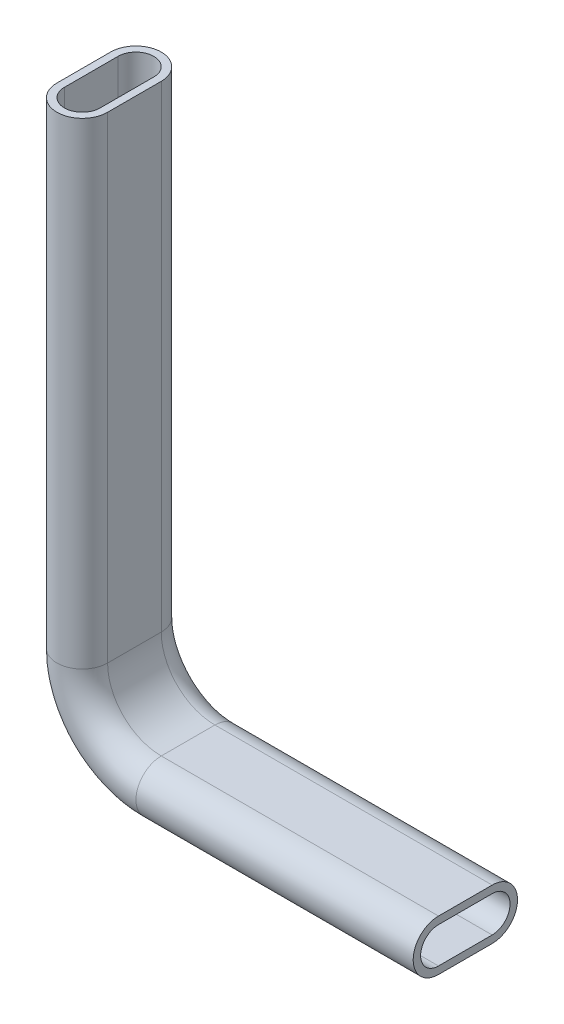
ISO-10303-21;
HEADER;
FILE_DESCRIPTION(('STEP AP214'),'2;1');
FILE_NAME('part.step','',(''),(''),'','','');
FILE_SCHEMA(('AUTOMOTIVE_DESIGN { 1 0 10303 214 1 1 1 1 }'));
ENDSEC;
DATA;
#1=APPLICATION_CONTEXT('core data for automotive mechanical design processes');
#2=APPLICATION_PROTOCOL_DEFINITION('international standard','automotive_design',2000,#1);
#3=PRODUCT_CONTEXT('',#1,'mechanical');
#4=PRODUCT('Part','Part','',(#3));
#5=PRODUCT_RELATED_PRODUCT_CATEGORY('part','',(#4));
#6=PRODUCT_DEFINITION_FORMATION('','',#4);
#7=PRODUCT_DEFINITION_CONTEXT('part definition',#1,'design');
#8=PRODUCT_DEFINITION('design','',#6,#7);
#9=PRODUCT_DEFINITION_SHAPE('','',#8);
#10=(LENGTH_UNIT() NAMED_UNIT(*) SI_UNIT(.MILLI.,.METRE.));
#11=(NAMED_UNIT(*) PLANE_ANGLE_UNIT() SI_UNIT($,.RADIAN.));
#12=(NAMED_UNIT(*) SI_UNIT($,.STERADIAN.) SOLID_ANGLE_UNIT());
#13=UNCERTAINTY_MEASURE_WITH_UNIT(LENGTH_MEASURE(1.E-05),#10,'distance_accuracy_value','');
#14=(GEOMETRIC_REPRESENTATION_CONTEXT(3) GLOBAL_UNCERTAINTY_ASSIGNED_CONTEXT((#13)) GLOBAL_UNIT_ASSIGNED_CONTEXT((#10,
#11,#12)) REPRESENTATION_CONTEXT('',''));
#15=CARTESIAN_POINT('',(0.,0.,0.));
#16=DIRECTION('',(0.,0.,1.));
#17=DIRECTION('',(1.,0.,0.));
#18=AXIS2_PLACEMENT_3D('',#15,#16,#17);
#19=CARTESIAN_POINT('',(-111.,26.5,9.));
#20=DIRECTION('',(-1.,0.,0.));
#21=DIRECTION('',(0.,0.,1.));
#22=AXIS2_PLACEMENT_3D('',#19,#20,#21);
#23=PLANE('',#22);
#24=DIRECTION('',(0.,0.,1.));
#25=VECTOR('',#24,1.);
#26=CARTESIAN_POINT('',(-111.,26.5,9.));
#27=LINE('',#26,#25);
#28=CARTESIAN_POINT('',(-111.,26.5,-9.));
#29=VERTEX_POINT('',#28);
#30=CARTESIAN_POINT('',(-111.,26.5,9.));
#31=VERTEX_POINT('',#30);
#32=EDGE_CURVE('E240',#29,#31,#27,.T.);
#33=ORIENTED_EDGE('',*,*,#32,.F.);
#34=DIRECTION('',(0.,1.,0.));
#35=VECTOR('',#34,1.);
#36=CARTESIAN_POINT('',(-111.,26.5,-9.));
#37=LINE('',#36,#35);
#38=CARTESIAN_POINT('',(-111.,186.5,-9.));
#39=VERTEX_POINT('',#38);
#40=EDGE_CURVE('E33',#29,#39,#37,.T.);
#41=ORIENTED_EDGE('',*,*,#40,.T.);
#42=DIRECTION('',(0.,0.,1.));
#43=VECTOR('',#42,1.);
#44=CARTESIAN_POINT('',(-111.,186.5,9.));
#45=LINE('',#44,#43);
#46=CARTESIAN_POINT('',(-111.,186.5,9.));
#47=VERTEX_POINT('',#46);
#48=EDGE_CURVE('E40',#39,#47,#45,.T.);
#49=ORIENTED_EDGE('',*,*,#48,.T.);
#50=DIRECTION('',(0.,1.,0.));
#51=VECTOR('',#50,1.);
#52=CARTESIAN_POINT('',(-111.,26.5,9.));
#53=LINE('',#52,#51);
#54=EDGE_CURVE('E11',#31,#47,#53,.T.);
#55=ORIENTED_EDGE('',*,*,#54,.F.);
#56=EDGE_LOOP('',(#33,#41,#49,#55));
#57=FACE_BOUND('',#56,.T.);
#58=ADVANCED_FACE('F26',(#57),#23,.F.);
#59=CARTESIAN_POINT('',(-119.5,26.5,-9.));
#60=DIRECTION('',(0.,1.,0.));
#61=DIRECTION('',(0.,0.,1.));
#62=AXIS2_PLACEMENT_3D('',#59,#60,#61);
#63=CYLINDRICAL_SURFACE('',#62,8.5);
#64=CARTESIAN_POINT('',(-119.5,26.5,-9.));
#65=DIRECTION('',(0.,-1.,0.));
#66=DIRECTION('',(0.,0.,1.));
#67=AXIS2_PLACEMENT_3D('',#64,#65,#66);
#68=CIRCLE('',#67,8.5);
#69=CARTESIAN_POINT('',(-128.,26.5,-9.));
#70=VERTEX_POINT('',#69);
#71=EDGE_CURVE('E237',#70,#29,#68,.T.);
#72=ORIENTED_EDGE('',*,*,#71,.F.);
#73=DIRECTION('',(0.,1.,0.));
#74=VECTOR('',#73,1.);
#75=CARTESIAN_POINT('',(-128.,26.5,-9.));
#76=LINE('',#75,#74);
#77=CARTESIAN_POINT('',(-128.,186.5,-9.));
#78=VERTEX_POINT('',#77);
#79=EDGE_CURVE('E298',#70,#78,#76,.T.);
#80=ORIENTED_EDGE('',*,*,#79,.T.);
#81=CARTESIAN_POINT('',(-119.5,186.5,-9.));
#82=DIRECTION('',(0.,-1.,0.));
#83=DIRECTION('',(0.,0.,1.));
#84=AXIS2_PLACEMENT_3D('',#81,#82,#83);
#85=CIRCLE('',#84,8.5);
#86=EDGE_CURVE('E48',#78,#39,#85,.T.);
#87=ORIENTED_EDGE('',*,*,#86,.T.);
#88=ORIENTED_EDGE('',*,*,#40,.F.);
#89=EDGE_LOOP('',(#72,#80,#87,#88));
#90=FACE_BOUND('',#89,.T.);
#91=ADVANCED_FACE('F301',(#90),#63,.T.);
#92=CARTESIAN_POINT('',(-128.,26.5,9.));
#93=DIRECTION('',(1.,0.,0.));
#94=DIRECTION('',(0.,0.,-1.));
#95=AXIS2_PLACEMENT_3D('',#92,#93,#94);
#96=PLANE('',#95);
#97=DIRECTION('',(0.,0.,-1.));
#98=VECTOR('',#97,1.);
#99=CARTESIAN_POINT('',(-128.,26.5,9.));
#100=LINE('',#99,#98);
#101=CARTESIAN_POINT('',(-128.,26.5,9.));
#102=VERTEX_POINT('',#101);
#103=EDGE_CURVE('E233',#102,#70,#100,.T.);
#104=ORIENTED_EDGE('',*,*,#103,.F.);
#105=DIRECTION('',(0.,1.,0.));
#106=VECTOR('',#105,1.);
#107=CARTESIAN_POINT('',(-128.,26.5,9.));
#108=LINE('',#107,#106);
#109=CARTESIAN_POINT('',(-128.,186.5,9.));
#110=VERTEX_POINT('',#109);
#111=EDGE_CURVE('E285',#102,#110,#108,.T.);
#112=ORIENTED_EDGE('',*,*,#111,.T.);
#113=DIRECTION('',(0.,0.,-1.));
#114=VECTOR('',#113,1.);
#115=CARTESIAN_POINT('',(-128.,186.5,9.));
#116=LINE('',#115,#114);
#117=EDGE_CURVE('E280',#110,#78,#116,.T.);
#118=ORIENTED_EDGE('',*,*,#117,.T.);
#119=ORIENTED_EDGE('',*,*,#79,.F.);
#120=EDGE_LOOP('',(#104,#112,#118,#119));
#121=FACE_BOUND('',#120,.T.);
#122=ADVANCED_FACE('F347',(#121),#96,.F.);
#123=CARTESIAN_POINT('',(-119.5,26.5,9.));
#124=DIRECTION('',(0.,1.,0.));
#125=DIRECTION('',(0.,0.,1.));
#126=AXIS2_PLACEMENT_3D('',#123,#124,#125);
#127=CYLINDRICAL_SURFACE('',#126,8.5);
#128=CARTESIAN_POINT('',(-119.5,26.5,9.));
#129=DIRECTION('',(0.,-1.,0.));
#130=DIRECTION('',(0.,0.,-1.));
#131=AXIS2_PLACEMENT_3D('',#128,#129,#130);
#132=CIRCLE('',#131,8.5);
#133=EDGE_CURVE('E230',#31,#102,#132,.T.);
#134=ORIENTED_EDGE('',*,*,#133,.F.);
#135=ORIENTED_EDGE('',*,*,#54,.T.);
#136=CARTESIAN_POINT('',(-119.5,186.5,9.));
#137=DIRECTION('',(0.,-1.,0.));
#138=DIRECTION('',(0.,0.,-1.));
#139=AXIS2_PLACEMENT_3D('',#136,#137,#138);
#140=CIRCLE('',#139,8.5);
#141=EDGE_CURVE('E278',#47,#110,#140,.T.);
#142=ORIENTED_EDGE('',*,*,#141,.T.);
#143=ORIENTED_EDGE('',*,*,#111,.F.);
#144=EDGE_LOOP('',(#134,#135,#142,#143));
#145=FACE_BOUND('',#144,.T.);
#146=ADVANCED_FACE('F328',(#145),#127,.T.);
#147=CARTESIAN_POINT('',(-125.5,26.5,9.));
#148=DIRECTION('',(1.,0.,0.));
#149=DIRECTION('',(0.,0.,-1.));
#150=AXIS2_PLACEMENT_3D('',#147,#148,#149);
#151=PLANE('',#150);
#152=DIRECTION('',(0.,0.,-1.));
#153=VECTOR('',#152,1.);
#154=CARTESIAN_POINT('',(-125.5,26.5,9.));
#155=LINE('',#154,#153);
#156=CARTESIAN_POINT('',(-125.5,26.5,9.));
#157=VERTEX_POINT('',#156);
#158=CARTESIAN_POINT('',(-125.5,26.5,-9.));
#159=VERTEX_POINT('',#158);
#160=EDGE_CURVE('E226',#157,#159,#155,.T.);
#161=ORIENTED_EDGE('',*,*,#160,.T.);
#162=DIRECTION('',(0.,1.,0.));
#163=VECTOR('',#162,1.);
#164=CARTESIAN_POINT('',(-125.5,26.5,-9.));
#165=LINE('',#164,#163);
#166=CARTESIAN_POINT('',(-125.5,186.5,-9.));
#167=VERTEX_POINT('',#166);
#168=EDGE_CURVE('E291',#159,#167,#165,.T.);
#169=ORIENTED_EDGE('',*,*,#168,.T.);
#170=DIRECTION('',(0.,0.,-1.));
#171=VECTOR('',#170,1.);
#172=CARTESIAN_POINT('',(-125.5,186.5,9.));
#173=LINE('',#172,#171);
#174=CARTESIAN_POINT('',(-125.5,186.5,9.));
#175=VERTEX_POINT('',#174);
#176=EDGE_CURVE('E274',#175,#167,#173,.T.);
#177=ORIENTED_EDGE('',*,*,#176,.F.);
#178=DIRECTION('',(0.,1.,0.));
#179=VECTOR('',#178,1.);
#180=CARTESIAN_POINT('',(-125.5,26.5,9.));
#181=LINE('',#180,#179);
#182=EDGE_CURVE('E281',#157,#175,#181,.T.);
#183=ORIENTED_EDGE('',*,*,#182,.F.);
#184=EDGE_LOOP('',(#161,#169,#177,#183));
#185=FACE_BOUND('',#184,.T.);
#186=ADVANCED_FACE('F355',(#185),#151,.T.);
#187=CARTESIAN_POINT('',(-119.5,26.5,-9.));
#188=DIRECTION('',(0.,1.,0.));
#189=DIRECTION('',(0.,0.,1.));
#190=AXIS2_PLACEMENT_3D('',#187,#188,#189);
#191=CYLINDRICAL_SURFACE('',#190,6.);
#192=CARTESIAN_POINT('',(-119.5,26.5,-9.));
#193=DIRECTION('',(0.,-1.,0.));
#194=DIRECTION('',(0.,0.,1.));
#195=AXIS2_PLACEMENT_3D('',#192,#193,#194);
#196=CIRCLE('',#195,6.);
#197=CARTESIAN_POINT('',(-113.5,26.5,-9.));
#198=VERTEX_POINT('',#197);
#199=EDGE_CURVE('E223',#159,#198,#196,.T.);
#200=ORIENTED_EDGE('',*,*,#199,.T.);
#201=DIRECTION('',(0.,1.,0.));
#202=VECTOR('',#201,1.);
#203=CARTESIAN_POINT('',(-113.5,26.5,-9.));
#204=LINE('',#203,#202);
#205=CARTESIAN_POINT('',(-113.5,186.5,-9.));
#206=VERTEX_POINT('',#205);
#207=EDGE_CURVE('E288',#198,#206,#204,.T.);
#208=ORIENTED_EDGE('',*,*,#207,.T.);
#209=CARTESIAN_POINT('',(-119.5,186.5,-9.));
#210=DIRECTION('',(0.,-1.,0.));
#211=DIRECTION('',(0.,0.,1.));
#212=AXIS2_PLACEMENT_3D('',#209,#210,#211);
#213=CIRCLE('',#212,6.);
#214=EDGE_CURVE('E271',#167,#206,#213,.T.);
#215=ORIENTED_EDGE('',*,*,#214,.F.);
#216=ORIENTED_EDGE('',*,*,#168,.F.);
#217=EDGE_LOOP('',(#200,#208,#215,#216));
#218=FACE_BOUND('',#217,.T.);
#219=ADVANCED_FACE('F358',(#218),#191,.F.);
#220=CARTESIAN_POINT('',(-113.5,26.5,9.));
#221=DIRECTION('',(-1.,0.,0.));
#222=DIRECTION('',(0.,0.,1.));
#223=AXIS2_PLACEMENT_3D('',#220,#221,#222);
#224=PLANE('',#223);
#225=DIRECTION('',(0.,0.,1.));
#226=VECTOR('',#225,1.);
#227=CARTESIAN_POINT('',(-113.5,26.5,9.));
#228=LINE('',#227,#226);
#229=CARTESIAN_POINT('',(-113.5,26.5,9.));
#230=VERTEX_POINT('',#229);
#231=EDGE_CURVE('E220',#198,#230,#228,.T.);
#232=ORIENTED_EDGE('',*,*,#231,.T.);
#233=DIRECTION('',(0.,1.,0.));
#234=VECTOR('',#233,1.);
#235=CARTESIAN_POINT('',(-113.5,26.5,9.));
#236=LINE('',#235,#234);
#237=CARTESIAN_POINT('',(-113.5,186.5,9.));
#238=VERTEX_POINT('',#237);
#239=EDGE_CURVE('E277',#230,#238,#236,.T.);
#240=ORIENTED_EDGE('',*,*,#239,.T.);
#241=DIRECTION('',(0.,0.,1.));
#242=VECTOR('',#241,1.);
#243=CARTESIAN_POINT('',(-113.5,186.5,9.));
#244=LINE('',#243,#242);
#245=EDGE_CURVE('E268',#206,#238,#244,.T.);
#246=ORIENTED_EDGE('',*,*,#245,.F.);
#247=ORIENTED_EDGE('',*,*,#207,.F.);
#248=EDGE_LOOP('',(#232,#240,#246,#247));
#249=FACE_BOUND('',#248,.T.);
#250=ADVANCED_FACE('F362',(#249),#224,.T.);
#251=CARTESIAN_POINT('',(-119.5,26.5,9.));
#252=DIRECTION('',(0.,1.,0.));
#253=DIRECTION('',(0.,0.,1.));
#254=AXIS2_PLACEMENT_3D('',#251,#252,#253);
#255=CYLINDRICAL_SURFACE('',#254,6.);
#256=CARTESIAN_POINT('',(-119.5,26.5,9.));
#257=DIRECTION('',(0.,-1.,0.));
#258=DIRECTION('',(0.,0.,-1.));
#259=AXIS2_PLACEMENT_3D('',#256,#257,#258);
#260=CIRCLE('',#259,6.);
#261=EDGE_CURVE('E205',#230,#157,#260,.T.);
#262=ORIENTED_EDGE('',*,*,#261,.T.);
#263=ORIENTED_EDGE('',*,*,#182,.T.);
#264=CARTESIAN_POINT('',(-119.5,186.5,9.));
#265=DIRECTION('',(0.,-1.,0.));
#266=DIRECTION('',(0.,0.,-1.));
#267=AXIS2_PLACEMENT_3D('',#264,#265,#266);
#268=CIRCLE('',#267,6.);
#269=EDGE_CURVE('E265',#238,#175,#268,.T.);
#270=ORIENTED_EDGE('',*,*,#269,.F.);
#271=ORIENTED_EDGE('',*,*,#239,.F.);
#272=EDGE_LOOP('',(#262,#263,#270,#271));
#273=FACE_BOUND('',#272,.T.);
#274=ADVANCED_FACE('F366',(#273),#255,.F.);
#275=CARTESIAN_POINT('',(-93.,26.5,0.));
#276=DIRECTION('',(0.,0.,-1.));
#277=DIRECTION('',(-1.,0.,0.));
#278=AXIS2_PLACEMENT_3D('',#275,#276,#277);
#279=CYLINDRICAL_SURFACE('',#278,18.);
#280=DIRECTION('',(0.,0.,1.));
#281=VECTOR('',#280,1.);
#282=CARTESIAN_POINT('',(-93.,8.5,9.));
#283=LINE('',#282,#281);
#284=CARTESIAN_POINT('',(-93.,8.5,-9.));
#285=VERTEX_POINT('',#284);
#286=CARTESIAN_POINT('',(-93.,8.5,9.));
#287=VERTEX_POINT('',#286);
#288=EDGE_CURVE('E160',#285,#287,#283,.T.);
#289=ORIENTED_EDGE('',*,*,#288,.F.);
#290=CARTESIAN_POINT('',(-93.,26.5,-9.));
#291=DIRECTION('',(0.,0.,-1.));
#292=DIRECTION('',(-1.,0.,0.));
#293=AXIS2_PLACEMENT_3D('',#290,#291,#292);
#294=CIRCLE('',#293,18.);
#295=EDGE_CURVE('E259',#285,#29,#294,.T.);
#296=ORIENTED_EDGE('',*,*,#295,.T.);
#297=ORIENTED_EDGE('',*,*,#32,.T.);
#298=CARTESIAN_POINT('',(-93.,26.5,9.));
#299=DIRECTION('',(0.,0.,-1.));
#300=DIRECTION('',(-1.,0.,0.));
#301=AXIS2_PLACEMENT_3D('',#298,#299,#300);
#302=CIRCLE('',#301,18.);
#303=EDGE_CURVE('E262',#287,#31,#302,.T.);
#304=ORIENTED_EDGE('',*,*,#303,.F.);
#305=EDGE_LOOP('',(#289,#296,#297,#304));
#306=FACE_BOUND('',#305,.T.);
#307=ADVANCED_FACE('F330',(#306),#279,.F.);
#308=CARTESIAN_POINT('',(-93.,26.5,-9.));
#309=DIRECTION('',(0.,0.,-1.));
#310=DIRECTION('',(-1.,0.,0.));
#311=AXIS2_PLACEMENT_3D('',#308,#309,#310);
#312=TOROIDAL_SURFACE('',#311,26.5,8.5);
#313=CARTESIAN_POINT('',(-93.,0.,-9.));
#314=DIRECTION('',(1.,0.,0.));
#315=DIRECTION('',(0.,0.,1.));
#316=AXIS2_PLACEMENT_3D('',#313,#314,#315);
#317=CIRCLE('',#316,8.5);
#318=CARTESIAN_POINT('',(-93.,-8.5,-9.));
#319=VERTEX_POINT('',#318);
#320=EDGE_CURVE('E198',#319,#285,#317,.T.);
#321=ORIENTED_EDGE('',*,*,#320,.F.);
#322=CARTESIAN_POINT('',(-93.,26.5,-9.));
#323=DIRECTION('',(0.,0.,-1.));
#324=DIRECTION('',(-1.,0.,0.));
#325=AXIS2_PLACEMENT_3D('',#322,#323,#324);
#326=CIRCLE('',#325,35.);
#327=EDGE_CURVE('E256',#319,#70,#326,.T.);
#328=ORIENTED_EDGE('',*,*,#327,.T.);
#329=ORIENTED_EDGE('',*,*,#71,.T.);
#330=ORIENTED_EDGE('',*,*,#295,.F.);
#331=EDGE_LOOP('',(#321,#328,#329,#330));
#332=FACE_BOUND('',#331,.T.);
#333=ADVANCED_FACE('F309',(#332),#312,.T.);
#334=CARTESIAN_POINT('',(-93.,26.5,0.));
#335=DIRECTION('',(0.,0.,-1.));
#336=DIRECTION('',(-1.,0.,0.));
#337=AXIS2_PLACEMENT_3D('',#334,#335,#336);
#338=CYLINDRICAL_SURFACE('',#337,35.);
#339=DIRECTION('',(0.,0.,-1.));
#340=VECTOR('',#339,1.);
#341=CARTESIAN_POINT('',(-93.,-8.5,9.));
#342=LINE('',#341,#340);
#343=CARTESIAN_POINT('',(-93.,-8.5,9.));
#344=VERTEX_POINT('',#343);
#345=EDGE_CURVE('E195',#344,#319,#342,.T.);
#346=ORIENTED_EDGE('',*,*,#345,.F.);
#347=CARTESIAN_POINT('',(-93.,26.5,9.));
#348=DIRECTION('',(0.,0.,-1.));
#349=DIRECTION('',(-1.,0.,0.));
#350=AXIS2_PLACEMENT_3D('',#347,#348,#349);
#351=CIRCLE('',#350,35.);
#352=EDGE_CURVE('E243',#344,#102,#351,.T.);
#353=ORIENTED_EDGE('',*,*,#352,.T.);
#354=ORIENTED_EDGE('',*,*,#103,.T.);
#355=ORIENTED_EDGE('',*,*,#327,.F.);
#356=EDGE_LOOP('',(#346,#353,#354,#355));
#357=FACE_BOUND('',#356,.T.);
#358=ADVANCED_FACE('F306',(#357),#338,.T.);
#359=CARTESIAN_POINT('',(-93.,26.5,9.));
#360=DIRECTION('',(0.,0.,-1.));
#361=DIRECTION('',(-1.,0.,0.));
#362=AXIS2_PLACEMENT_3D('',#359,#360,#361);
#363=TOROIDAL_SURFACE('',#362,26.5,8.5);
#364=CARTESIAN_POINT('',(-93.,0.,9.));
#365=DIRECTION('',(1.,0.,0.));
#366=DIRECTION('',(0.,0.,-1.));
#367=AXIS2_PLACEMENT_3D('',#364,#365,#366);
#368=CIRCLE('',#367,8.5);
#369=EDGE_CURVE('E192',#287,#344,#368,.T.);
#370=ORIENTED_EDGE('',*,*,#369,.F.);
#371=ORIENTED_EDGE('',*,*,#303,.T.);
#372=ORIENTED_EDGE('',*,*,#133,.T.);
#373=ORIENTED_EDGE('',*,*,#352,.F.);
#374=EDGE_LOOP('',(#370,#371,#372,#373));
#375=FACE_BOUND('',#374,.T.);
#376=ADVANCED_FACE('F325',(#375),#363,.T.);
#377=CARTESIAN_POINT('',(-93.,26.5,0.));
#378=DIRECTION('',(0.,0.,-1.));
#379=DIRECTION('',(-1.,0.,0.));
#380=AXIS2_PLACEMENT_3D('',#377,#378,#379);
#381=CYLINDRICAL_SURFACE('',#380,32.5);
#382=DIRECTION('',(0.,0.,-1.));
#383=VECTOR('',#382,1.);
#384=CARTESIAN_POINT('',(-93.,-6.,9.));
#385=LINE('',#384,#383);
#386=CARTESIAN_POINT('',(-93.,-6.,9.));
#387=VERTEX_POINT('',#386);
#388=CARTESIAN_POINT('',(-93.,-6.,-9.));
#389=VERTEX_POINT('',#388);
#390=EDGE_CURVE('E189',#387,#389,#385,.T.);
#391=ORIENTED_EDGE('',*,*,#390,.T.);
#392=CARTESIAN_POINT('',(-93.,26.5,-9.));
#393=DIRECTION('',(0.,0.,-1.));
#394=DIRECTION('',(-1.,0.,0.));
#395=AXIS2_PLACEMENT_3D('',#392,#393,#394);
#396=CIRCLE('',#395,32.5);
#397=EDGE_CURVE('E249',#389,#159,#396,.T.);
#398=ORIENTED_EDGE('',*,*,#397,.T.);
#399=ORIENTED_EDGE('',*,*,#160,.F.);
#400=CARTESIAN_POINT('',(-93.,26.5,9.));
#401=DIRECTION('',(0.,0.,-1.));
#402=DIRECTION('',(-1.,0.,0.));
#403=AXIS2_PLACEMENT_3D('',#400,#401,#402);
#404=CIRCLE('',#403,32.5);
#405=EDGE_CURVE('E234',#387,#157,#404,.T.);
#406=ORIENTED_EDGE('',*,*,#405,.F.);
#407=EDGE_LOOP('',(#391,#398,#399,#406));
#408=FACE_BOUND('',#407,.T.);
#409=ADVANCED_FACE('F379',(#408),#381,.F.);
#410=CARTESIAN_POINT('',(-93.,26.5,-9.));
#411=DIRECTION('',(0.,0.,-1.));
#412=DIRECTION('',(-1.,0.,0.));
#413=AXIS2_PLACEMENT_3D('',#410,#411,#412);
#414=TOROIDAL_SURFACE('',#413,26.5,6.);
#415=CARTESIAN_POINT('',(-93.,0.,-9.));
#416=DIRECTION('',(1.,0.,0.));
#417=DIRECTION('',(0.,0.,1.));
#418=AXIS2_PLACEMENT_3D('',#415,#416,#417);
#419=CIRCLE('',#418,6.);
#420=CARTESIAN_POINT('',(-93.,6.,-9.));
#421=VERTEX_POINT('',#420);
#422=EDGE_CURVE('E186',#389,#421,#419,.T.);
#423=ORIENTED_EDGE('',*,*,#422,.T.);
#424=CARTESIAN_POINT('',(-93.,26.5,-9.));
#425=DIRECTION('',(0.,0.,-1.));
#426=DIRECTION('',(-1.,0.,0.));
#427=AXIS2_PLACEMENT_3D('',#424,#425,#426);
#428=CIRCLE('',#427,20.5);
#429=EDGE_CURVE('E246',#421,#198,#428,.T.);
#430=ORIENTED_EDGE('',*,*,#429,.T.);
#431=ORIENTED_EDGE('',*,*,#199,.F.);
#432=ORIENTED_EDGE('',*,*,#397,.F.);
#433=EDGE_LOOP('',(#423,#430,#431,#432));
#434=FACE_BOUND('',#433,.T.);
#435=ADVANCED_FACE('F382',(#434),#414,.F.);
#436=CARTESIAN_POINT('',(-93.,26.5,0.));
#437=DIRECTION('',(0.,0.,-1.));
#438=DIRECTION('',(-1.,0.,0.));
#439=AXIS2_PLACEMENT_3D('',#436,#437,#438);
#440=CYLINDRICAL_SURFACE('',#439,20.5);
#441=DIRECTION('',(0.,0.,1.));
#442=VECTOR('',#441,1.);
#443=CARTESIAN_POINT('',(-93.,6.,9.));
#444=LINE('',#443,#442);
#445=CARTESIAN_POINT('',(-93.,6.,9.));
#446=VERTEX_POINT('',#445);
#447=EDGE_CURVE('E183',#421,#446,#444,.T.);
#448=ORIENTED_EDGE('',*,*,#447,.T.);
#449=CARTESIAN_POINT('',(-93.,26.5,9.));
#450=DIRECTION('',(0.,0.,-1.));
#451=DIRECTION('',(-1.,0.,0.));
#452=AXIS2_PLACEMENT_3D('',#449,#450,#451);
#453=CIRCLE('',#452,20.5);
#454=EDGE_CURVE('E229',#446,#230,#453,.T.);
#455=ORIENTED_EDGE('',*,*,#454,.T.);
#456=ORIENTED_EDGE('',*,*,#231,.F.);
#457=ORIENTED_EDGE('',*,*,#429,.F.);
#458=EDGE_LOOP('',(#448,#455,#456,#457));
#459=FACE_BOUND('',#458,.T.);
#460=ADVANCED_FACE('F386',(#459),#440,.T.);
#461=CARTESIAN_POINT('',(-93.,26.5,9.));
#462=DIRECTION('',(0.,0.,-1.));
#463=DIRECTION('',(-1.,0.,0.));
#464=AXIS2_PLACEMENT_3D('',#461,#462,#463);
#465=TOROIDAL_SURFACE('',#464,26.5,6.);
#466=CARTESIAN_POINT('',(-93.,0.,9.));
#467=DIRECTION('',(1.,0.,0.));
#468=DIRECTION('',(0.,0.,-1.));
#469=AXIS2_PLACEMENT_3D('',#466,#467,#468);
#470=CIRCLE('',#469,6.);
#471=EDGE_CURVE('E159',#446,#387,#470,.T.);
#472=ORIENTED_EDGE('',*,*,#471,.T.);
#473=ORIENTED_EDGE('',*,*,#405,.T.);
#474=ORIENTED_EDGE('',*,*,#261,.F.);
#475=ORIENTED_EDGE('',*,*,#454,.F.);
#476=EDGE_LOOP('',(#472,#473,#474,#475));
#477=FACE_BOUND('',#476,.T.);
#478=ADVANCED_FACE('F390',(#477),#465,.F.);
#479=CARTESIAN_POINT('',(-93.,0.,9.));
#480=DIRECTION('',(1.,0.,0.));
#481=DIRECTION('',(0.,0.,-1.));
#482=AXIS2_PLACEMENT_3D('',#479,#480,#481);
#483=CYLINDRICAL_SURFACE('',#482,8.5);
#484=CARTESIAN_POINT('',(0.,0.,9.));
#485=DIRECTION('',(1.,0.,0.));
#486=DIRECTION('',(0.,0.,-1.));
#487=AXIS2_PLACEMENT_3D('',#484,#485,#486);
#488=CIRCLE('',#487,8.5);
#489=CARTESIAN_POINT('',(0.,8.5,9.));
#490=VERTEX_POINT('',#489);
#491=CARTESIAN_POINT('',(0.,-8.5,9.));
#492=VERTEX_POINT('',#491);
#493=EDGE_CURVE('E170',#490,#492,#488,.T.);
#494=ORIENTED_EDGE('',*,*,#493,.F.);
#495=DIRECTION('',(1.,0.,0.));
#496=VECTOR('',#495,1.);
#497=CARTESIAN_POINT('',(-93.,8.5,9.));
#498=LINE('',#497,#496);
#499=EDGE_CURVE('E203',#287,#490,#498,.T.);
#500=ORIENTED_EDGE('',*,*,#499,.F.);
#501=ORIENTED_EDGE('',*,*,#369,.T.);
#502=DIRECTION('',(1.,0.,0.));
#503=VECTOR('',#502,1.);
#504=CARTESIAN_POINT('',(-93.,-8.5,9.));
#505=LINE('',#504,#503);
#506=EDGE_CURVE('E210',#344,#492,#505,.T.);
#507=ORIENTED_EDGE('',*,*,#506,.T.);
#508=EDGE_LOOP('',(#494,#500,#501,#507));
#509=FACE_BOUND('',#508,.T.);
#510=ADVANCED_FACE('F323',(#509),#483,.T.);
#511=CARTESIAN_POINT('',(-93.,8.5,9.));
#512=DIRECTION('',(0.,1.,0.));
#513=DIRECTION('',(0.,0.,1.));
#514=AXIS2_PLACEMENT_3D('',#511,#512,#513);
#515=PLANE('',#514);
#516=DIRECTION('',(0.,0.,1.));
#517=VECTOR('',#516,1.);
#518=CARTESIAN_POINT('',(0.,8.5,9.));
#519=LINE('',#518,#517);
#520=CARTESIAN_POINT('',(0.,8.5,-9.));
#521=VERTEX_POINT('',#520);
#522=EDGE_CURVE('E179',#521,#490,#519,.T.);
#523=ORIENTED_EDGE('',*,*,#522,.F.);
#524=DIRECTION('',(1.,0.,0.));
#525=VECTOR('',#524,1.);
#526=CARTESIAN_POINT('',(-93.,8.5,-9.));
#527=LINE('',#526,#525);
#528=EDGE_CURVE('E206',#285,#521,#527,.T.);
#529=ORIENTED_EDGE('',*,*,#528,.F.);
#530=ORIENTED_EDGE('',*,*,#288,.T.);
#531=ORIENTED_EDGE('',*,*,#499,.T.);
#532=EDGE_LOOP('',(#523,#529,#530,#531));
#533=FACE_BOUND('',#532,.T.);
#534=ADVANCED_FACE('F334',(#533),#515,.T.);
#535=CARTESIAN_POINT('',(-93.,0.,-9.));
#536=DIRECTION('',(1.,0.,0.));
#537=DIRECTION('',(0.,0.,-1.));
#538=AXIS2_PLACEMENT_3D('',#535,#536,#537);
#539=CYLINDRICAL_SURFACE('',#538,8.5);
#540=CARTESIAN_POINT('',(0.,0.,-9.));
#541=DIRECTION('',(1.,0.,0.));
#542=DIRECTION('',(0.,0.,1.));
#543=AXIS2_PLACEMENT_3D('',#540,#541,#542);
#544=CIRCLE('',#543,8.5);
#545=CARTESIAN_POINT('',(0.,-8.5,-9.));
#546=VERTEX_POINT('',#545);
#547=EDGE_CURVE('E176',#546,#521,#544,.T.);
#548=ORIENTED_EDGE('',*,*,#547,.F.);
#549=DIRECTION('',(1.,0.,0.));
#550=VECTOR('',#549,1.);
#551=CARTESIAN_POINT('',(-93.,-8.5,-9.));
#552=LINE('',#551,#550);
#553=EDGE_CURVE('E208',#319,#546,#552,.T.);
#554=ORIENTED_EDGE('',*,*,#553,.F.);
#555=ORIENTED_EDGE('',*,*,#320,.T.);
#556=ORIENTED_EDGE('',*,*,#528,.T.);
#557=EDGE_LOOP('',(#548,#554,#555,#556));
#558=FACE_BOUND('',#557,.T.);
#559=ADVANCED_FACE('F314',(#558),#539,.T.);
#560=CARTESIAN_POINT('',(-93.,0.,9.));
#561=DIRECTION('',(1.,0.,0.));
#562=DIRECTION('',(0.,0.,-1.));
#563=AXIS2_PLACEMENT_3D('',#560,#561,#562);
#564=CYLINDRICAL_SURFACE('',#563,6.);
#565=CARTESIAN_POINT('',(0.,0.,9.));
#566=DIRECTION('',(1.,0.,0.));
#567=DIRECTION('',(0.,0.,-1.));
#568=AXIS2_PLACEMENT_3D('',#565,#566,#567);
#569=CIRCLE('',#568,6.);
#570=CARTESIAN_POINT('',(0.,6.,9.));
#571=VERTEX_POINT('',#570);
#572=CARTESIAN_POINT('',(0.,-6.,9.));
#573=VERTEX_POINT('',#572);
#574=EDGE_CURVE('E152',#571,#573,#569,.T.);
#575=ORIENTED_EDGE('',*,*,#574,.T.);
#576=DIRECTION('',(1.,0.,0.));
#577=VECTOR('',#576,1.);
#578=CARTESIAN_POINT('',(-93.,-6.,9.));
#579=LINE('',#578,#577);
#580=EDGE_CURVE('E212',#387,#573,#579,.T.);
#581=ORIENTED_EDGE('',*,*,#580,.F.);
#582=ORIENTED_EDGE('',*,*,#471,.F.);
#583=DIRECTION('',(1.,0.,0.));
#584=VECTOR('',#583,1.);
#585=CARTESIAN_POINT('',(-93.,6.,9.));
#586=LINE('',#585,#584);
#587=EDGE_CURVE('E144',#446,#571,#586,.T.);
#588=ORIENTED_EDGE('',*,*,#587,.T.);
#589=EDGE_LOOP('',(#575,#581,#582,#588));
#590=FACE_BOUND('',#589,.T.);
#591=ADVANCED_FACE('F156',(#590),#564,.F.);
#592=CARTESIAN_POINT('',(-93.,-6.,9.));
#593=DIRECTION('',(0.,-1.,0.));
#594=DIRECTION('',(0.,0.,-1.));
#595=AXIS2_PLACEMENT_3D('',#592,#593,#594);
#596=PLANE('',#595);
#597=DIRECTION('',(0.,0.,-1.));
#598=VECTOR('',#597,1.);
#599=CARTESIAN_POINT('',(0.,-6.,9.));
#600=LINE('',#599,#598);
#601=CARTESIAN_POINT('',(0.,-6.,-9.));
#602=VERTEX_POINT('',#601);
#603=EDGE_CURVE('E164',#573,#602,#600,.T.);
#604=ORIENTED_EDGE('',*,*,#603,.T.);
#605=DIRECTION('',(1.,0.,0.));
#606=VECTOR('',#605,1.);
#607=CARTESIAN_POINT('',(-93.,-6.,-9.));
#608=LINE('',#607,#606);
#609=EDGE_CURVE('E214',#389,#602,#608,.T.);
#610=ORIENTED_EDGE('',*,*,#609,.F.);
#611=ORIENTED_EDGE('',*,*,#390,.F.);
#612=ORIENTED_EDGE('',*,*,#580,.T.);
#613=EDGE_LOOP('',(#604,#610,#611,#612));
#614=FACE_BOUND('',#613,.T.);
#615=ADVANCED_FACE('F397',(#614),#596,.F.);
#616=CARTESIAN_POINT('',(-93.,0.,-9.));
#617=DIRECTION('',(1.,0.,0.));
#618=DIRECTION('',(0.,0.,-1.));
#619=AXIS2_PLACEMENT_3D('',#616,#617,#618);
#620=CYLINDRICAL_SURFACE('',#619,6.);
#621=CARTESIAN_POINT('',(0.,0.,-9.));
#622=DIRECTION('',(1.,0.,0.));
#623=DIRECTION('',(0.,0.,1.));
#624=AXIS2_PLACEMENT_3D('',#621,#622,#623);
#625=CIRCLE('',#624,6.);
#626=CARTESIAN_POINT('',(0.,6.,-9.));
#627=VERTEX_POINT('',#626);
#628=EDGE_CURVE('E151',#602,#627,#625,.T.);
#629=ORIENTED_EDGE('',*,*,#628,.T.);
#630=DIRECTION('',(1.,0.,0.));
#631=VECTOR('',#630,1.);
#632=CARTESIAN_POINT('',(-93.,6.,-9.));
#633=LINE('',#632,#631);
#634=EDGE_CURVE('E147',#421,#627,#633,.T.);
#635=ORIENTED_EDGE('',*,*,#634,.F.);
#636=ORIENTED_EDGE('',*,*,#422,.F.);
#637=ORIENTED_EDGE('',*,*,#609,.T.);
#638=EDGE_LOOP('',(#629,#635,#636,#637));
#639=FACE_BOUND('',#638,.T.);
#640=ADVANCED_FACE('F400',(#639),#620,.F.);
#641=CARTESIAN_POINT('',(-93.,6.,9.));
#642=DIRECTION('',(0.,1.,0.));
#643=DIRECTION('',(0.,0.,1.));
#644=AXIS2_PLACEMENT_3D('',#641,#642,#643);
#645=PLANE('',#644);
#646=DIRECTION('',(0.,0.,1.));
#647=VECTOR('',#646,1.);
#648=CARTESIAN_POINT('',(0.,6.,9.));
#649=LINE('',#648,#647);
#650=EDGE_CURVE('E140',#627,#571,#649,.T.);
#651=ORIENTED_EDGE('',*,*,#650,.T.);
#652=ORIENTED_EDGE('',*,*,#587,.F.);
#653=ORIENTED_EDGE('',*,*,#447,.F.);
#654=ORIENTED_EDGE('',*,*,#634,.T.);
#655=EDGE_LOOP('',(#651,#652,#653,#654));
#656=FACE_BOUND('',#655,.T.);
#657=ADVANCED_FACE('F142',(#656),#645,.F.);
#658=CARTESIAN_POINT('',(-93.,-8.5,9.));
#659=DIRECTION('',(0.,-1.,0.));
#660=DIRECTION('',(0.,0.,-1.));
#661=AXIS2_PLACEMENT_3D('',#658,#659,#660);
#662=PLANE('',#661);
#663=DIRECTION('',(0.,0.,-1.));
#664=VECTOR('',#663,1.);
#665=CARTESIAN_POINT('',(0.,-8.5,9.));
#666=LINE('',#665,#664);
#667=EDGE_CURVE('E173',#492,#546,#666,.T.);
#668=ORIENTED_EDGE('',*,*,#667,.F.);
#669=ORIENTED_EDGE('',*,*,#506,.F.);
#670=ORIENTED_EDGE('',*,*,#345,.T.);
#671=ORIENTED_EDGE('',*,*,#553,.T.);
#672=EDGE_LOOP('',(#668,#669,#670,#671));
#673=FACE_BOUND('',#672,.T.);
#674=ADVANCED_FACE('F318',(#673),#662,.T.);
#675=CARTESIAN_POINT('',(-119.5,186.5,9.));
#676=DIRECTION('',(0.,-1.,0.));
#677=DIRECTION('',(0.,0.,-1.));
#678=AXIS2_PLACEMENT_3D('',#675,#676,#677);
#679=PLANE('',#678);
#680=ORIENTED_EDGE('',*,*,#269,.T.);
#681=ORIENTED_EDGE('',*,*,#176,.T.);
#682=ORIENTED_EDGE('',*,*,#214,.T.);
#683=ORIENTED_EDGE('',*,*,#245,.T.);
#684=EDGE_LOOP('',(#680,#681,#682,#683));
#685=FACE_BOUND('',#684,.T.);
#686=ORIENTED_EDGE('',*,*,#141,.F.);
#687=ORIENTED_EDGE('',*,*,#48,.F.);
#688=ORIENTED_EDGE('',*,*,#86,.F.);
#689=ORIENTED_EDGE('',*,*,#117,.F.);
#690=EDGE_LOOP('',(#686,#687,#688,#689));
#691=FACE_BOUND('',#690,.T.);
#692=ADVANCED_FACE('F336',(#685,#691),#679,.F.);
#693=CARTESIAN_POINT('',(0.,0.,9.));
#694=DIRECTION('',(1.,0.,0.));
#695=DIRECTION('',(0.,0.,-1.));
#696=AXIS2_PLACEMENT_3D('',#693,#694,#695);
#697=PLANE('',#696);
#698=ORIENTED_EDGE('',*,*,#574,.F.);
#699=ORIENTED_EDGE('',*,*,#650,.F.);
#700=ORIENTED_EDGE('',*,*,#628,.F.);
#701=ORIENTED_EDGE('',*,*,#603,.F.);
#702=EDGE_LOOP('',(#698,#699,#700,#701));
#703=FACE_BOUND('',#702,.T.);
#704=ORIENTED_EDGE('',*,*,#493,.T.);
#705=ORIENTED_EDGE('',*,*,#667,.T.);
#706=ORIENTED_EDGE('',*,*,#547,.T.);
#707=ORIENTED_EDGE('',*,*,#522,.T.);
#708=EDGE_LOOP('',(#704,#705,#706,#707));
#709=FACE_BOUND('',#708,.T.);
#710=ADVANCED_FACE('F162',(#703,#709),#697,.T.);
#711=CLOSED_SHELL('',(#58,#91,#122,#146,#186,#219,#250,#274,#307,#333,#358,#376,#409,#435,#460,
#478,#510,#534,#559,#591,#615,#640,#657,#674,#692,#710));
#712=MANIFOLD_SOLID_BREP('B2',#711);
#713=ADVANCED_BREP_SHAPE_REPRESENTATION('',(#18,#712),#14);
#714=SHAPE_DEFINITION_REPRESENTATION(#9,#713);
ENDSEC;
END-ISO-10303-21;
